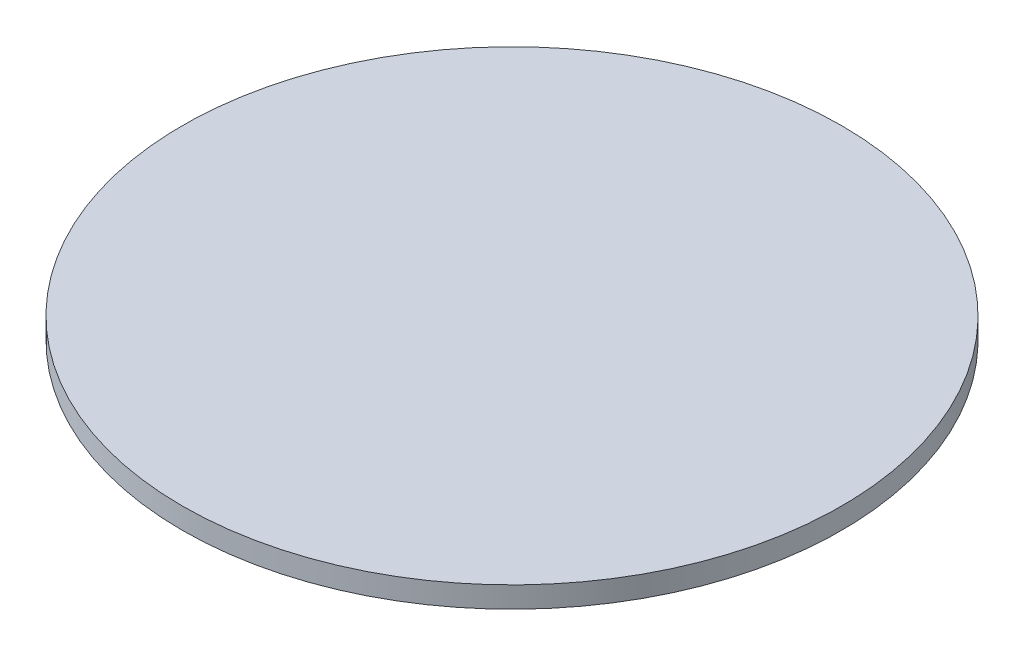
ISO-10303-21;
HEADER;
FILE_DESCRIPTION(('STEP AP214'),'2;1');
FILE_NAME('part.step','',(''),(''),'','','');
FILE_SCHEMA(('AUTOMOTIVE_DESIGN { 1 0 10303 214 1 1 1 1 }'));
ENDSEC;
DATA;
#1=APPLICATION_CONTEXT('core data for automotive mechanical design processes');
#2=APPLICATION_PROTOCOL_DEFINITION('international standard','automotive_design',2000,#1);
#3=PRODUCT_CONTEXT('',#1,'mechanical');
#4=PRODUCT('Part','Part','',(#3));
#5=PRODUCT_RELATED_PRODUCT_CATEGORY('part','',(#4));
#6=PRODUCT_DEFINITION_FORMATION('','',#4);
#7=PRODUCT_DEFINITION_CONTEXT('part definition',#1,'design');
#8=PRODUCT_DEFINITION('design','',#6,#7);
#9=PRODUCT_DEFINITION_SHAPE('','',#8);
#10=(LENGTH_UNIT() NAMED_UNIT(*) SI_UNIT(.MILLI.,.METRE.));
#11=(NAMED_UNIT(*) PLANE_ANGLE_UNIT() SI_UNIT($,.RADIAN.));
#12=(NAMED_UNIT(*) SI_UNIT($,.STERADIAN.) SOLID_ANGLE_UNIT());
#13=UNCERTAINTY_MEASURE_WITH_UNIT(LENGTH_MEASURE(1.E-05),#10,'distance_accuracy_value','');
#14=(GEOMETRIC_REPRESENTATION_CONTEXT(3) GLOBAL_UNCERTAINTY_ASSIGNED_CONTEXT((#13)) GLOBAL_UNIT_ASSIGNED_CONTEXT((#10,
#11,#12)) REPRESENTATION_CONTEXT('',''));
#15=CARTESIAN_POINT('',(0.,0.,0.));
#16=DIRECTION('',(0.,0.,1.));
#17=DIRECTION('',(1.,0.,0.));
#18=AXIS2_PLACEMENT_3D('',#15,#16,#17);
#19=CARTESIAN_POINT('',(0.,4.,0.));
#20=DIRECTION('',(0.,-1.,0.));
#21=DIRECTION('',(0.,0.,-1.));
#22=AXIS2_PLACEMENT_3D('',#19,#20,#21);
#23=CYLINDRICAL_SURFACE('',#22,62.5);
#24=CARTESIAN_POINT('',(0.,4.,0.));
#25=DIRECTION('',(0.,1.,0.));
#26=DIRECTION('',(0.,0.,1.));
#27=AXIS2_PLACEMENT_3D('',#24,#25,#26);
#28=CIRCLE('',#27,62.5);
#29=CARTESIAN_POINT('',(0.,4.,62.5));
#30=VERTEX_POINT('',#29);
#31=EDGE_CURVE('E10',#30,#30,#28,.T.);
#32=ORIENTED_EDGE('',*,*,#31,.F.);
#33=EDGE_LOOP('',(#32));
#34=FACE_BOUND('',#33,.T.);
#35=CARTESIAN_POINT('',(0.,0.,0.));
#36=DIRECTION('',(0.,1.,0.));
#37=DIRECTION('',(0.,0.,1.));
#38=AXIS2_PLACEMENT_3D('',#35,#36,#37);
#39=CIRCLE('',#38,62.5);
#40=CARTESIAN_POINT('',(0.,0.,62.5));
#41=VERTEX_POINT('',#40);
#42=EDGE_CURVE('E34',#41,#41,#39,.T.);
#43=ORIENTED_EDGE('',*,*,#42,.T.);
#44=EDGE_LOOP('',(#43));
#45=FACE_BOUND('',#44,.T.);
#46=ADVANCED_FACE('F31',(#34,#45),#23,.T.);
#47=CARTESIAN_POINT('',(0.,4.,0.));
#48=DIRECTION('',(0.,1.,0.));
#49=DIRECTION('',(0.,0.,1.));
#50=AXIS2_PLACEMENT_3D('',#47,#48,#49);
#51=PLANE('',#50);
#52=ORIENTED_EDGE('',*,*,#31,.T.);
#53=EDGE_LOOP('',(#52));
#54=FACE_BOUND('',#53,.T.);
#55=ADVANCED_FACE('F46',(#54),#51,.T.);
#56=CARTESIAN_POINT('',(0.,0.,0.));
#57=DIRECTION('',(0.,1.,0.));
#58=DIRECTION('',(0.,0.,1.));
#59=AXIS2_PLACEMENT_3D('',#56,#57,#58);
#60=PLANE('',#59);
#61=ORIENTED_EDGE('',*,*,#42,.F.);
#62=EDGE_LOOP('',(#61));
#63=FACE_BOUND('',#62,.T.);
#64=ADVANCED_FACE('F44',(#63),#60,.F.);
#65=CLOSED_SHELL('',(#46,#55,#64));
#66=MANIFOLD_SOLID_BREP('B2',#65);
#67=ADVANCED_BREP_SHAPE_REPRESENTATION('',(#18,#66),#14);
#68=SHAPE_DEFINITION_REPRESENTATION(#9,#67);
ENDSEC;
END-ISO-10303-21;
